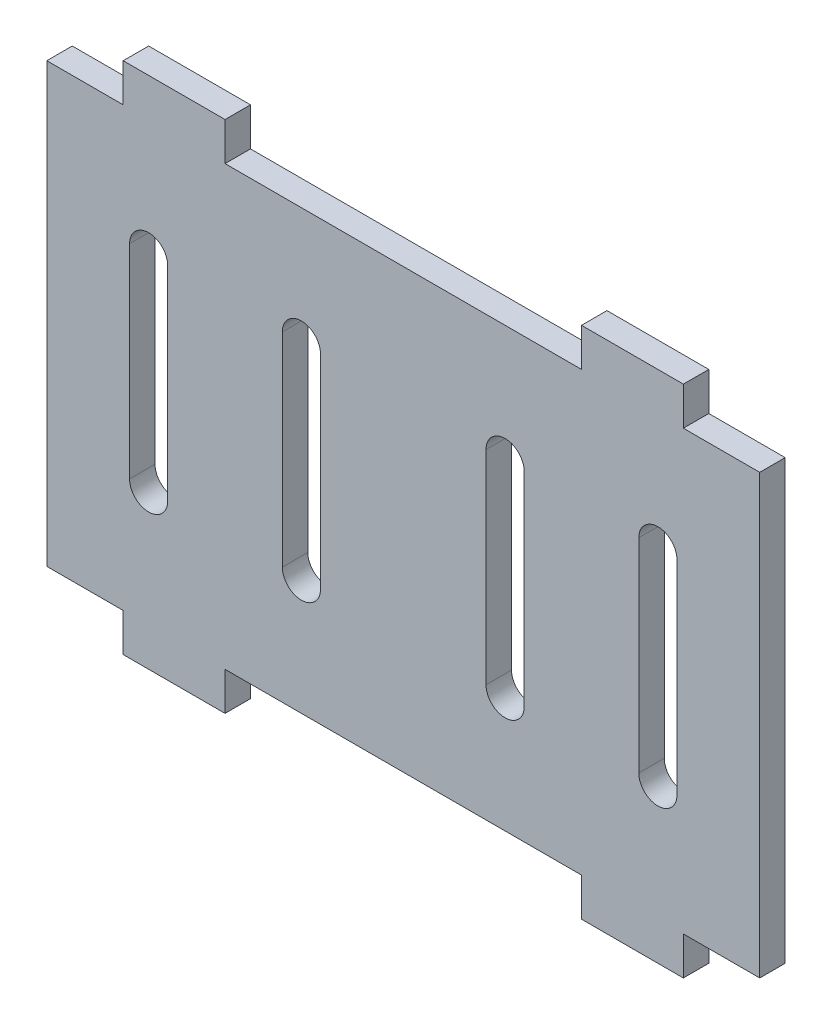
ISO-10303-21;
HEADER;
FILE_DESCRIPTION(('STEP AP214'),'2;1');
FILE_NAME('part.step','',(''),(''),'','','');
FILE_SCHEMA(('AUTOMOTIVE_DESIGN { 1 0 10303 214 1 1 1 1 }'));
ENDSEC;
DATA;
#1=APPLICATION_CONTEXT('core data for automotive mechanical design processes');
#2=APPLICATION_PROTOCOL_DEFINITION('international standard','automotive_design',2000,#1);
#3=PRODUCT_CONTEXT('',#1,'mechanical');
#4=PRODUCT('Part','Part','',(#3));
#5=PRODUCT_RELATED_PRODUCT_CATEGORY('part','',(#4));
#6=PRODUCT_DEFINITION_FORMATION('','',#4);
#7=PRODUCT_DEFINITION_CONTEXT('part definition',#1,'design');
#8=PRODUCT_DEFINITION('design','',#6,#7);
#9=PRODUCT_DEFINITION_SHAPE('','',#8);
#10=(LENGTH_UNIT() NAMED_UNIT(*) SI_UNIT(.MILLI.,.METRE.));
#11=(NAMED_UNIT(*) PLANE_ANGLE_UNIT() SI_UNIT($,.RADIAN.));
#12=(NAMED_UNIT(*) SI_UNIT($,.STERADIAN.) SOLID_ANGLE_UNIT());
#13=UNCERTAINTY_MEASURE_WITH_UNIT(LENGTH_MEASURE(1.E-05),#10,'distance_accuracy_value','');
#14=(GEOMETRIC_REPRESENTATION_CONTEXT(3) GLOBAL_UNCERTAINTY_ASSIGNED_CONTEXT((#13)) GLOBAL_UNIT_ASSIGNED_CONTEXT((#10,
#11,#12)) REPRESENTATION_CONTEXT('',''));
#15=CARTESIAN_POINT('',(0.,0.,0.));
#16=DIRECTION('',(0.,0.,1.));
#17=DIRECTION('',(1.,0.,0.));
#18=AXIS2_PLACEMENT_3D('',#15,#16,#17);
#19=CARTESIAN_POINT('',(0.,0.,2.));
#20=DIRECTION('',(0.,0.,1.));
#21=DIRECTION('',(1.,0.,0.));
#22=AXIS2_PLACEMENT_3D('',#19,#20,#21);
#23=PLANE('',#22);
#24=DIRECTION('',(1.,0.,0.));
#25=VECTOR('',#24,1.);
#26=CARTESIAN_POINT('',(0.,20.2,2.));
#27=LINE('',#26,#25);
#28=CARTESIAN_POINT('',(-22.,20.2,2.));
#29=VERTEX_POINT('',#28);
#30=CARTESIAN_POINT('',(-14.,20.2,2.));
#31=VERTEX_POINT('',#30);
#32=EDGE_CURVE('E268',#29,#31,#27,.T.);
#33=ORIENTED_EDGE('',*,*,#32,.F.);
#34=DIRECTION('',(0.,-1.,0.));
#35=VECTOR('',#34,1.);
#36=CARTESIAN_POINT('',(-22.,23.2,2.));
#37=LINE('',#36,#35);
#38=CARTESIAN_POINT('',(-22.,17.2,2.));
#39=VERTEX_POINT('',#38);
#40=EDGE_CURVE('E294',#29,#39,#37,.T.);
#41=ORIENTED_EDGE('',*,*,#40,.T.);
#42=DIRECTION('',(-1.,0.,0.));
#43=VECTOR('',#42,1.);
#44=CARTESIAN_POINT('',(-28.0000000000001,17.2,2.));
#45=LINE('',#44,#43);
#46=CARTESIAN_POINT('',(-28.0000000000001,17.2,2.));
#47=VERTEX_POINT('',#46);
#48=EDGE_CURVE('E320',#39,#47,#45,.T.);
#49=ORIENTED_EDGE('',*,*,#48,.T.);
#50=DIRECTION('',(0.,-1.,0.));
#51=VECTOR('',#50,1.);
#52=CARTESIAN_POINT('',(-28.0000000000001,17.2,2.));
#53=LINE('',#52,#51);
#54=CARTESIAN_POINT('',(-28.0000000000001,-17.2,2.));
#55=VERTEX_POINT('',#54);
#56=EDGE_CURVE('E309',#47,#55,#53,.T.);
#57=ORIENTED_EDGE('',*,*,#56,.T.);
#58=DIRECTION('',(1.,0.,0.));
#59=VECTOR('',#58,1.);
#60=CARTESIAN_POINT('',(-28.0000000000001,-17.2,2.));
#61=LINE('',#60,#59);
#62=CARTESIAN_POINT('',(-22.,-17.2,2.));
#63=VERTEX_POINT('',#62);
#64=EDGE_CURVE('E314',#55,#63,#61,.T.);
#65=ORIENTED_EDGE('',*,*,#64,.T.);
#66=DIRECTION('',(0.,1.,0.));
#67=VECTOR('',#66,1.);
#68=CARTESIAN_POINT('',(-22.,-23.2,2.));
#69=LINE('',#68,#67);
#70=CARTESIAN_POINT('',(-22.,-20.2,2.));
#71=VERTEX_POINT('',#70);
#72=EDGE_CURVE('E304',#71,#63,#69,.T.);
#73=ORIENTED_EDGE('',*,*,#72,.F.);
#74=DIRECTION('',(-1.,0.,0.));
#75=VECTOR('',#74,1.);
#76=CARTESIAN_POINT('',(0.,-20.2,2.));
#77=LINE('',#76,#75);
#78=CARTESIAN_POINT('',(-14.,-20.2,2.));
#79=VERTEX_POINT('',#78);
#80=EDGE_CURVE('E50',#79,#71,#77,.T.);
#81=ORIENTED_EDGE('',*,*,#80,.F.);
#82=DIRECTION('',(0.,1.,0.));
#83=VECTOR('',#82,1.);
#84=CARTESIAN_POINT('',(-14.,-23.2,2.));
#85=LINE('',#84,#83);
#86=CARTESIAN_POINT('',(-14.,-17.2,2.));
#87=VERTEX_POINT('',#86);
#88=EDGE_CURVE('E306',#79,#87,#85,.T.);
#89=ORIENTED_EDGE('',*,*,#88,.T.);
#90=CARTESIAN_POINT('',(14.,-17.2,2.));
#91=VERTEX_POINT('',#90);
#92=EDGE_CURVE('E318',#87,#91,#61,.T.);
#93=ORIENTED_EDGE('',*,*,#92,.T.);
#94=DIRECTION('',(0.,1.,0.));
#95=VECTOR('',#94,1.);
#96=CARTESIAN_POINT('',(14.,-23.2,2.));
#97=LINE('',#96,#95);
#98=CARTESIAN_POINT('',(14.,-20.2,2.));
#99=VERTEX_POINT('',#98);
#100=EDGE_CURVE('E426',#99,#91,#97,.T.);
#101=ORIENTED_EDGE('',*,*,#100,.F.);
#102=CARTESIAN_POINT('',(22.,-20.2,2.));
#103=VERTEX_POINT('',#102);
#104=EDGE_CURVE('E272',#103,#99,#77,.T.);
#105=ORIENTED_EDGE('',*,*,#104,.F.);
#106=DIRECTION('',(0.,1.,0.));
#107=VECTOR('',#106,1.);
#108=CARTESIAN_POINT('',(22.,-23.2,2.));
#109=LINE('',#108,#107);
#110=CARTESIAN_POINT('',(22.,-17.2,2.));
#111=VERTEX_POINT('',#110);
#112=EDGE_CURVE('E428',#103,#111,#109,.T.);
#113=ORIENTED_EDGE('',*,*,#112,.T.);
#114=CARTESIAN_POINT('',(27.9999999999999,-17.2,2.));
#115=VERTEX_POINT('',#114);
#116=EDGE_CURVE('E312',#111,#115,#61,.T.);
#117=ORIENTED_EDGE('',*,*,#116,.T.);
#118=DIRECTION('',(0.,1.,0.));
#119=VECTOR('',#118,1.);
#120=CARTESIAN_POINT('',(27.9999999999999,17.2,2.));
#121=LINE('',#120,#119);
#122=CARTESIAN_POINT('',(27.9999999999999,17.2,2.));
#123=VERTEX_POINT('',#122);
#124=EDGE_CURVE('E317',#115,#123,#121,.T.);
#125=ORIENTED_EDGE('',*,*,#124,.T.);
#126=CARTESIAN_POINT('',(22.,17.2,2.));
#127=VERTEX_POINT('',#126);
#128=EDGE_CURVE('E321',#123,#127,#45,.T.);
#129=ORIENTED_EDGE('',*,*,#128,.T.);
#130=DIRECTION('',(0.,-1.,0.));
#131=VECTOR('',#130,1.);
#132=CARTESIAN_POINT('',(22.,23.2,2.));
#133=LINE('',#132,#131);
#134=CARTESIAN_POINT('',(22.,20.2,2.));
#135=VERTEX_POINT('',#134);
#136=EDGE_CURVE('E403',#135,#127,#133,.T.);
#137=ORIENTED_EDGE('',*,*,#136,.F.);
#138=CARTESIAN_POINT('',(14.,20.2,2.));
#139=VERTEX_POINT('',#138);
#140=EDGE_CURVE('E282',#139,#135,#27,.T.);
#141=ORIENTED_EDGE('',*,*,#140,.F.);
#142=DIRECTION('',(0.,-1.,0.));
#143=VECTOR('',#142,1.);
#144=CARTESIAN_POINT('',(14.,23.2,2.));
#145=LINE('',#144,#143);
#146=CARTESIAN_POINT('',(14.,17.2,2.));
#147=VERTEX_POINT('',#146);
#148=EDGE_CURVE('E413',#139,#147,#145,.T.);
#149=ORIENTED_EDGE('',*,*,#148,.T.);
#150=CARTESIAN_POINT('',(-14.,17.2,2.));
#151=VERTEX_POINT('',#150);
#152=EDGE_CURVE('E325',#147,#151,#45,.T.);
#153=ORIENTED_EDGE('',*,*,#152,.T.);
#154=DIRECTION('',(0.,-1.,0.));
#155=VECTOR('',#154,1.);
#156=CARTESIAN_POINT('',(-14.,23.2,2.));
#157=LINE('',#156,#155);
#158=EDGE_CURVE('E438',#31,#151,#157,.T.);
#159=ORIENTED_EDGE('',*,*,#158,.F.);
#160=EDGE_LOOP('',(#33,#41,#49,#57,#65,#73,#81,#89,#93,#101,#105,#113,#117,#125,#129,#137,#141,
#149,#153,#159));
#161=FACE_BOUND('',#160,.T.);
#162=CARTESIAN_POINT('',(-20.,-7.99999999999998,2.));
#163=DIRECTION('',(0.,0.,1.));
#164=DIRECTION('',(1.,0.,0.));
#165=AXIS2_PLACEMENT_3D('',#162,#163,#164);
#166=CIRCLE('',#165,1.5);
#167=CARTESIAN_POINT('',(-21.5,-8.00000000000001,2.));
#168=VERTEX_POINT('',#167);
#169=CARTESIAN_POINT('',(-18.5,-8.00000000000001,2.));
#170=VERTEX_POINT('',#169);
#171=EDGE_CURVE('E478',#168,#170,#166,.T.);
#172=ORIENTED_EDGE('',*,*,#171,.F.);
#173=DIRECTION('',(0.,-1.,0.));
#174=VECTOR('',#173,1.);
#175=CARTESIAN_POINT('',(-21.5,-8.00000000000001,2.));
#176=LINE('',#175,#174);
#177=CARTESIAN_POINT('',(-21.5,8.,2.));
#178=VERTEX_POINT('',#177);
#179=EDGE_CURVE('E487',#178,#168,#176,.T.);
#180=ORIENTED_EDGE('',*,*,#179,.F.);
#181=CARTESIAN_POINT('',(-20.,7.99999999999999,2.));
#182=DIRECTION('',(0.,0.,1.));
#183=DIRECTION('',(1.,0.,0.));
#184=AXIS2_PLACEMENT_3D('',#181,#182,#183);
#185=CIRCLE('',#184,1.5);
#186=CARTESIAN_POINT('',(-18.5,8.,2.));
#187=VERTEX_POINT('',#186);
#188=EDGE_CURVE('E484',#187,#178,#185,.T.);
#189=ORIENTED_EDGE('',*,*,#188,.F.);
#190=DIRECTION('',(0.,1.,0.));
#191=VECTOR('',#190,1.);
#192=CARTESIAN_POINT('',(-18.5,-8.00000000000001,2.));
#193=LINE('',#192,#191);
#194=EDGE_CURVE('E480',#170,#187,#193,.T.);
#195=ORIENTED_EDGE('',*,*,#194,.F.);
#196=EDGE_LOOP('',(#172,#180,#189,#195));
#197=FACE_BOUND('',#196,.T.);
#198=CARTESIAN_POINT('',(-8.,-8.,2.));
#199=DIRECTION('',(0.,0.,1.));
#200=DIRECTION('',(1.,0.,0.));
#201=AXIS2_PLACEMENT_3D('',#198,#199,#200);
#202=CIRCLE('',#201,1.5);
#203=CARTESIAN_POINT('',(-9.5,-8.00000000000001,2.));
#204=VERTEX_POINT('',#203);
#205=CARTESIAN_POINT('',(-6.5,-8.00000000000001,2.));
#206=VERTEX_POINT('',#205);
#207=EDGE_CURVE('E499',#204,#206,#202,.T.);
#208=ORIENTED_EDGE('',*,*,#207,.F.);
#209=DIRECTION('',(0.,-1.,0.));
#210=VECTOR('',#209,1.);
#211=CARTESIAN_POINT('',(-9.5,-8.00000000000001,2.));
#212=LINE('',#211,#210);
#213=CARTESIAN_POINT('',(-9.5,8.,2.));
#214=VERTEX_POINT('',#213);
#215=EDGE_CURVE('E508',#214,#204,#212,.T.);
#216=ORIENTED_EDGE('',*,*,#215,.F.);
#217=CARTESIAN_POINT('',(-8.,8.,2.));
#218=DIRECTION('',(0.,0.,1.));
#219=DIRECTION('',(1.,0.,0.));
#220=AXIS2_PLACEMENT_3D('',#217,#218,#219);
#221=CIRCLE('',#220,1.5);
#222=CARTESIAN_POINT('',(-6.5,8.00000000000001,2.));
#223=VERTEX_POINT('',#222);
#224=EDGE_CURVE('E505',#223,#214,#221,.T.);
#225=ORIENTED_EDGE('',*,*,#224,.F.);
#226=DIRECTION('',(0.,1.,0.));
#227=VECTOR('',#226,1.);
#228=CARTESIAN_POINT('',(-6.5,-8.00000000000001,2.));
#229=LINE('',#228,#227);
#230=EDGE_CURVE('E501',#206,#223,#229,.T.);
#231=ORIENTED_EDGE('',*,*,#230,.F.);
#232=EDGE_LOOP('',(#208,#216,#225,#231));
#233=FACE_BOUND('',#232,.T.);
#234=CARTESIAN_POINT('',(8.,-8.,2.));
#235=DIRECTION('',(0.,0.,1.));
#236=DIRECTION('',(1.,0.,0.));
#237=AXIS2_PLACEMENT_3D('',#234,#235,#236);
#238=CIRCLE('',#237,1.5);
#239=CARTESIAN_POINT('',(6.5,-8.00000000000001,2.));
#240=VERTEX_POINT('',#239);
#241=CARTESIAN_POINT('',(9.5,-8.,2.));
#242=VERTEX_POINT('',#241);
#243=EDGE_CURVE('E519',#240,#242,#238,.T.);
#244=ORIENTED_EDGE('',*,*,#243,.F.);
#245=DIRECTION('',(0.,-1.,0.));
#246=VECTOR('',#245,1.);
#247=CARTESIAN_POINT('',(6.5,-8.00000000000001,2.));
#248=LINE('',#247,#246);
#249=CARTESIAN_POINT('',(6.5,8.00000000000001,2.));
#250=VERTEX_POINT('',#249);
#251=EDGE_CURVE('E528',#250,#240,#248,.T.);
#252=ORIENTED_EDGE('',*,*,#251,.F.);
#253=CARTESIAN_POINT('',(8.,8.,2.));
#254=DIRECTION('',(0.,0.,1.));
#255=DIRECTION('',(1.,0.,0.));
#256=AXIS2_PLACEMENT_3D('',#253,#254,#255);
#257=CIRCLE('',#256,1.5);
#258=CARTESIAN_POINT('',(9.5,8.00000000000001,2.));
#259=VERTEX_POINT('',#258);
#260=EDGE_CURVE('E525',#259,#250,#257,.T.);
#261=ORIENTED_EDGE('',*,*,#260,.F.);
#262=DIRECTION('',(0.,1.,0.));
#263=VECTOR('',#262,1.);
#264=CARTESIAN_POINT('',(9.5,-8.,2.));
#265=LINE('',#264,#263);
#266=EDGE_CURVE('E521',#242,#259,#265,.T.);
#267=ORIENTED_EDGE('',*,*,#266,.F.);
#268=EDGE_LOOP('',(#244,#252,#261,#267));
#269=FACE_BOUND('',#268,.T.);
#270=CARTESIAN_POINT('',(20.,-8.,2.));
#271=DIRECTION('',(0.,0.,1.));
#272=DIRECTION('',(-1.,0.,0.));
#273=AXIS2_PLACEMENT_3D('',#270,#271,#272);
#274=CIRCLE('',#273,1.50000000000001);
#275=CARTESIAN_POINT('',(18.5,-8.,2.));
#276=VERTEX_POINT('',#275);
#277=CARTESIAN_POINT('',(21.5,-8.,2.));
#278=VERTEX_POINT('',#277);
#279=EDGE_CURVE('E477',#276,#278,#274,.T.);
#280=ORIENTED_EDGE('',*,*,#279,.F.);
#281=DIRECTION('',(0.,-1.,0.));
#282=VECTOR('',#281,1.);
#283=CARTESIAN_POINT('',(18.5,-8.,2.));
#284=LINE('',#283,#282);
#285=CARTESIAN_POINT('',(18.5,8.00000000000001,2.));
#286=VERTEX_POINT('',#285);
#287=EDGE_CURVE('E546',#286,#276,#284,.T.);
#288=ORIENTED_EDGE('',*,*,#287,.F.);
#289=CARTESIAN_POINT('',(20.,8.,2.));
#290=DIRECTION('',(0.,0.,1.));
#291=DIRECTION('',(-1.,0.,0.));
#292=AXIS2_PLACEMENT_3D('',#289,#290,#291);
#293=CIRCLE('',#292,1.50000000000001);
#294=CARTESIAN_POINT('',(21.5,8.00000000000001,2.));
#295=VERTEX_POINT('',#294);
#296=EDGE_CURVE('E543',#295,#286,#293,.T.);
#297=ORIENTED_EDGE('',*,*,#296,.F.);
#298=DIRECTION('',(0.,1.,0.));
#299=VECTOR('',#298,1.);
#300=CARTESIAN_POINT('',(21.5,-8.,2.));
#301=LINE('',#300,#299);
#302=EDGE_CURVE('E540',#278,#295,#301,.T.);
#303=ORIENTED_EDGE('',*,*,#302,.F.);
#304=EDGE_LOOP('',(#280,#288,#297,#303));
#305=FACE_BOUND('',#304,.T.);
#306=ADVANCED_FACE('F35',(#161,#197,#233,#269,#305),#23,.T.);
#307=CARTESIAN_POINT('',(-28.0000000000001,17.2,2.));
#308=DIRECTION('',(0.,-1.,0.));
#309=DIRECTION('',(0.,0.,-1.));
#310=AXIS2_PLACEMENT_3D('',#307,#308,#309);
#311=PLANE('',#310);
#312=DIRECTION('',(0.,0.,1.));
#313=VECTOR('',#312,1.);
#314=CARTESIAN_POINT('',(14.,17.2,0.));
#315=LINE('',#314,#313);
#316=CARTESIAN_POINT('',(14.,17.2,0.));
#317=VERTEX_POINT('',#316);
#318=EDGE_CURVE('E454',#317,#147,#315,.T.);
#319=ORIENTED_EDGE('',*,*,#318,.F.);
#320=DIRECTION('',(-1.,0.,0.));
#321=VECTOR('',#320,1.);
#322=CARTESIAN_POINT('',(-28.0000000000001,17.2,0.));
#323=LINE('',#322,#321);
#324=CARTESIAN_POINT('',(-14.,17.2,0.));
#325=VERTEX_POINT('',#324);
#326=EDGE_CURVE('E338',#317,#325,#323,.T.);
#327=ORIENTED_EDGE('',*,*,#326,.T.);
#328=DIRECTION('',(0.,0.,1.));
#329=VECTOR('',#328,1.);
#330=CARTESIAN_POINT('',(-14.,17.2,0.));
#331=LINE('',#330,#329);
#332=EDGE_CURVE('E288',#325,#151,#331,.T.);
#333=ORIENTED_EDGE('',*,*,#332,.T.);
#334=ORIENTED_EDGE('',*,*,#152,.F.);
#335=EDGE_LOOP('',(#319,#327,#333,#334));
#336=FACE_BOUND('',#335,.T.);
#337=ADVANCED_FACE('F453',(#336),#311,.F.);
#338=DIRECTION('',(0.,0.,-1.));
#339=VECTOR('',#338,1.);
#340=CARTESIAN_POINT('',(22.,17.2,0.));
#341=LINE('',#340,#339);
#342=CARTESIAN_POINT('',(22.,17.2,0.));
#343=VERTEX_POINT('',#342);
#344=EDGE_CURVE('E558',#127,#343,#341,.T.);
#345=ORIENTED_EDGE('',*,*,#344,.F.);
#346=ORIENTED_EDGE('',*,*,#128,.F.);
#347=DIRECTION('',(0.,0.,-1.));
#348=VECTOR('',#347,1.);
#349=CARTESIAN_POINT('',(27.9999999999999,17.2,2.));
#350=LINE('',#349,#348);
#351=CARTESIAN_POINT('',(27.9999999999999,17.2,0.));
#352=VERTEX_POINT('',#351);
#353=EDGE_CURVE('E341',#123,#352,#350,.T.);
#354=ORIENTED_EDGE('',*,*,#353,.T.);
#355=EDGE_CURVE('E313',#352,#343,#323,.T.);
#356=ORIENTED_EDGE('',*,*,#355,.T.);
#357=EDGE_LOOP('',(#345,#346,#354,#356));
#358=FACE_BOUND('',#357,.T.);
#359=ADVANCED_FACE('F599',(#358),#311,.F.);
#360=CARTESIAN_POINT('',(-28.0000000000001,-17.2,2.));
#361=DIRECTION('',(0.,1.,0.));
#362=DIRECTION('',(0.,0.,1.));
#363=AXIS2_PLACEMENT_3D('',#360,#361,#362);
#364=PLANE('',#363);
#365=DIRECTION('',(1.,0.,0.));
#366=VECTOR('',#365,1.);
#367=CARTESIAN_POINT('',(-28.0000000000001,-17.2,0.));
#368=LINE('',#367,#366);
#369=CARTESIAN_POINT('',(-14.,-17.2,0.));
#370=VERTEX_POINT('',#369);
#371=CARTESIAN_POINT('',(14.,-17.2,0.));
#372=VERTEX_POINT('',#371);
#373=EDGE_CURVE('E333',#370,#372,#368,.T.);
#374=ORIENTED_EDGE('',*,*,#373,.T.);
#375=DIRECTION('',(0.,0.,1.));
#376=VECTOR('',#375,1.);
#377=CARTESIAN_POINT('',(14.,-17.2,0.));
#378=LINE('',#377,#376);
#379=EDGE_CURVE('E415',#372,#91,#378,.T.);
#380=ORIENTED_EDGE('',*,*,#379,.T.);
#381=ORIENTED_EDGE('',*,*,#92,.F.);
#382=DIRECTION('',(0.,0.,1.));
#383=VECTOR('',#382,1.);
#384=CARTESIAN_POINT('',(-14.,-17.2,0.));
#385=LINE('',#384,#383);
#386=EDGE_CURVE('E289',#370,#87,#385,.T.);
#387=ORIENTED_EDGE('',*,*,#386,.F.);
#388=EDGE_LOOP('',(#374,#380,#381,#387));
#389=FACE_BOUND('',#388,.T.);
#390=ADVANCED_FACE('F627',(#389),#364,.F.);
#391=ORIENTED_EDGE('',*,*,#116,.F.);
#392=DIRECTION('',(0.,0.,-1.));
#393=VECTOR('',#392,1.);
#394=CARTESIAN_POINT('',(22.,-17.2,0.));
#395=LINE('',#394,#393);
#396=CARTESIAN_POINT('',(22.,-17.2,0.));
#397=VERTEX_POINT('',#396);
#398=EDGE_CURVE('E423',#111,#397,#395,.T.);
#399=ORIENTED_EDGE('',*,*,#398,.T.);
#400=CARTESIAN_POINT('',(27.9999999999999,-17.2,0.));
#401=VERTEX_POINT('',#400);
#402=EDGE_CURVE('E328',#397,#401,#368,.T.);
#403=ORIENTED_EDGE('',*,*,#402,.T.);
#404=DIRECTION('',(0.,0.,-1.));
#405=VECTOR('',#404,1.);
#406=CARTESIAN_POINT('',(27.9999999999999,-17.2,2.));
#407=LINE('',#406,#405);
#408=EDGE_CURVE('E344',#115,#401,#407,.T.);
#409=ORIENTED_EDGE('',*,*,#408,.F.);
#410=EDGE_LOOP('',(#391,#399,#403,#409));
#411=FACE_BOUND('',#410,.T.);
#412=ADVANCED_FACE('F593',(#411),#364,.F.);
#413=DIRECTION('',(0.,0.,-1.));
#414=VECTOR('',#413,1.);
#415=CARTESIAN_POINT('',(-22.,-17.2,0.));
#416=LINE('',#415,#414);
#417=CARTESIAN_POINT('',(-22.,-17.2,0.));
#418=VERTEX_POINT('',#417);
#419=EDGE_CURVE('E292',#63,#418,#416,.T.);
#420=ORIENTED_EDGE('',*,*,#419,.F.);
#421=ORIENTED_EDGE('',*,*,#64,.F.);
#422=DIRECTION('',(0.,0.,-1.));
#423=VECTOR('',#422,1.);
#424=CARTESIAN_POINT('',(-28.0000000000001,-17.2,2.));
#425=LINE('',#424,#423);
#426=CARTESIAN_POINT('',(-28.0000000000001,-17.2,0.));
#427=VERTEX_POINT('',#426);
#428=EDGE_CURVE('E347',#55,#427,#425,.T.);
#429=ORIENTED_EDGE('',*,*,#428,.T.);
#430=EDGE_CURVE('E329',#427,#418,#368,.T.);
#431=ORIENTED_EDGE('',*,*,#430,.T.);
#432=EDGE_LOOP('',(#420,#421,#429,#431));
#433=FACE_BOUND('',#432,.T.);
#434=ADVANCED_FACE('F463',(#433),#364,.F.);
#435=CARTESIAN_POINT('',(-28.0000000000001,17.2,2.));
#436=DIRECTION('',(1.,0.,0.));
#437=DIRECTION('',(0.,0.,-1.));
#438=AXIS2_PLACEMENT_3D('',#435,#436,#437);
#439=PLANE('',#438);
#440=DIRECTION('',(0.,-1.,0.));
#441=VECTOR('',#440,1.);
#442=CARTESIAN_POINT('',(-28.0000000000001,17.2,0.));
#443=LINE('',#442,#441);
#444=CARTESIAN_POINT('',(-28.0000000000001,17.2,0.));
#445=VERTEX_POINT('',#444);
#446=EDGE_CURVE('E308',#445,#427,#443,.T.);
#447=ORIENTED_EDGE('',*,*,#446,.T.);
#448=ORIENTED_EDGE('',*,*,#428,.F.);
#449=ORIENTED_EDGE('',*,*,#56,.F.);
#450=DIRECTION('',(0.,0.,-1.));
#451=VECTOR('',#450,1.);
#452=CARTESIAN_POINT('',(-28.0000000000001,17.2,2.));
#453=LINE('',#452,#451);
#454=EDGE_CURVE('E324',#47,#445,#453,.T.);
#455=ORIENTED_EDGE('',*,*,#454,.T.);
#456=EDGE_LOOP('',(#447,#448,#449,#455));
#457=FACE_BOUND('',#456,.T.);
#458=ADVANCED_FACE('F37',(#457),#439,.F.);
#459=CARTESIAN_POINT('',(27.9999999999999,17.2,2.));
#460=DIRECTION('',(-1.,0.,0.));
#461=DIRECTION('',(0.,0.,1.));
#462=AXIS2_PLACEMENT_3D('',#459,#460,#461);
#463=PLANE('',#462);
#464=DIRECTION('',(0.,1.,0.));
#465=VECTOR('',#464,1.);
#466=CARTESIAN_POINT('',(27.9999999999999,17.2,0.));
#467=LINE('',#466,#465);
#468=EDGE_CURVE('E332',#401,#352,#467,.T.);
#469=ORIENTED_EDGE('',*,*,#468,.T.);
#470=ORIENTED_EDGE('',*,*,#353,.F.);
#471=ORIENTED_EDGE('',*,*,#124,.F.);
#472=ORIENTED_EDGE('',*,*,#408,.T.);
#473=EDGE_LOOP('',(#469,#470,#471,#472));
#474=FACE_BOUND('',#473,.T.);
#475=ADVANCED_FACE('F597',(#474),#463,.F.);
#476=ORIENTED_EDGE('',*,*,#48,.F.);
#477=DIRECTION('',(0.,0.,-1.));
#478=VECTOR('',#477,1.);
#479=CARTESIAN_POINT('',(-22.,17.2,0.));
#480=LINE('',#479,#478);
#481=CARTESIAN_POINT('',(-22.,17.2,0.));
#482=VERTEX_POINT('',#481);
#483=EDGE_CURVE('E435',#39,#482,#480,.T.);
#484=ORIENTED_EDGE('',*,*,#483,.T.);
#485=EDGE_CURVE('E335',#482,#445,#323,.T.);
#486=ORIENTED_EDGE('',*,*,#485,.T.);
#487=ORIENTED_EDGE('',*,*,#454,.F.);
#488=EDGE_LOOP('',(#476,#484,#486,#487));
#489=FACE_BOUND('',#488,.T.);
#490=ADVANCED_FACE('F446',(#489),#311,.F.);
#491=CARTESIAN_POINT('',(0.,0.,0.));
#492=DIRECTION('',(0.,0.,1.));
#493=DIRECTION('',(1.,0.,0.));
#494=AXIS2_PLACEMENT_3D('',#491,#492,#493);
#495=PLANE('',#494);
#496=DIRECTION('',(0.,-1.,0.));
#497=VECTOR('',#496,1.);
#498=CARTESIAN_POINT('',(-21.5,0.,0.));
#499=LINE('',#498,#497);
#500=CARTESIAN_POINT('',(-21.5,8.,0.));
#501=VERTEX_POINT('',#500);
#502=CARTESIAN_POINT('',(-21.5,-8.00000000000001,0.));
#503=VERTEX_POINT('',#502);
#504=EDGE_CURVE('E392',#501,#503,#499,.T.);
#505=ORIENTED_EDGE('',*,*,#504,.T.);
#506=CARTESIAN_POINT('',(-20.,-7.99999999999998,0.));
#507=DIRECTION('',(0.,0.,1.));
#508=DIRECTION('',(1.,0.,0.));
#509=AXIS2_PLACEMENT_3D('',#506,#507,#508);
#510=CIRCLE('',#509,1.5);
#511=CARTESIAN_POINT('',(-18.5,-8.00000000000001,0.));
#512=VERTEX_POINT('',#511);
#513=EDGE_CURVE('E395',#503,#512,#510,.T.);
#514=ORIENTED_EDGE('',*,*,#513,.T.);
#515=DIRECTION('',(0.,1.,0.));
#516=VECTOR('',#515,1.);
#517=CARTESIAN_POINT('',(-18.5,0.,0.));
#518=LINE('',#517,#516);
#519=CARTESIAN_POINT('',(-18.5,8.,0.));
#520=VERTEX_POINT('',#519);
#521=EDGE_CURVE('E386',#512,#520,#518,.T.);
#522=ORIENTED_EDGE('',*,*,#521,.T.);
#523=CARTESIAN_POINT('',(-20.,7.99999999999999,0.));
#524=DIRECTION('',(0.,0.,1.));
#525=DIRECTION('',(1.,0.,0.));
#526=AXIS2_PLACEMENT_3D('',#523,#524,#525);
#527=CIRCLE('',#526,1.5);
#528=EDGE_CURVE('E389',#520,#501,#527,.T.);
#529=ORIENTED_EDGE('',*,*,#528,.T.);
#530=EDGE_LOOP('',(#505,#514,#522,#529));
#531=FACE_BOUND('',#530,.T.);
#532=DIRECTION('',(0.,-1.,0.));
#533=VECTOR('',#532,1.);
#534=CARTESIAN_POINT('',(-9.5,0.,0.));
#535=LINE('',#534,#533);
#536=CARTESIAN_POINT('',(-9.5,8.,0.));
#537=VERTEX_POINT('',#536);
#538=CARTESIAN_POINT('',(-9.5,-8.00000000000001,0.));
#539=VERTEX_POINT('',#538);
#540=EDGE_CURVE('E380',#537,#539,#535,.T.);
#541=ORIENTED_EDGE('',*,*,#540,.T.);
#542=CARTESIAN_POINT('',(-8.,-8.,0.));
#543=DIRECTION('',(0.,0.,1.));
#544=DIRECTION('',(1.,0.,0.));
#545=AXIS2_PLACEMENT_3D('',#542,#543,#544);
#546=CIRCLE('',#545,1.5);
#547=CARTESIAN_POINT('',(-6.5,-8.00000000000001,0.));
#548=VERTEX_POINT('',#547);
#549=EDGE_CURVE('E383',#539,#548,#546,.T.);
#550=ORIENTED_EDGE('',*,*,#549,.T.);
#551=DIRECTION('',(0.,1.,0.));
#552=VECTOR('',#551,1.);
#553=CARTESIAN_POINT('',(-6.5,0.,0.));
#554=LINE('',#553,#552);
#555=CARTESIAN_POINT('',(-6.5,8.00000000000001,0.));
#556=VERTEX_POINT('',#555);
#557=EDGE_CURVE('E374',#548,#556,#554,.T.);
#558=ORIENTED_EDGE('',*,*,#557,.T.);
#559=CARTESIAN_POINT('',(-8.,8.,0.));
#560=DIRECTION('',(0.,0.,1.));
#561=DIRECTION('',(1.,0.,0.));
#562=AXIS2_PLACEMENT_3D('',#559,#560,#561);
#563=CIRCLE('',#562,1.5);
#564=EDGE_CURVE('E377',#556,#537,#563,.T.);
#565=ORIENTED_EDGE('',*,*,#564,.T.);
#566=EDGE_LOOP('',(#541,#550,#558,#565));
#567=FACE_BOUND('',#566,.T.);
#568=DIRECTION('',(0.,-1.,0.));
#569=VECTOR('',#568,1.);
#570=CARTESIAN_POINT('',(6.5,0.,0.));
#571=LINE('',#570,#569);
#572=CARTESIAN_POINT('',(6.5,8.00000000000001,0.));
#573=VERTEX_POINT('',#572);
#574=CARTESIAN_POINT('',(6.5,-8.00000000000001,0.));
#575=VERTEX_POINT('',#574);
#576=EDGE_CURVE('E368',#573,#575,#571,.T.);
#577=ORIENTED_EDGE('',*,*,#576,.T.);
#578=CARTESIAN_POINT('',(8.,-8.,0.));
#579=DIRECTION('',(0.,0.,1.));
#580=DIRECTION('',(1.,0.,0.));
#581=AXIS2_PLACEMENT_3D('',#578,#579,#580);
#582=CIRCLE('',#581,1.5);
#583=CARTESIAN_POINT('',(9.5,-8.,0.));
#584=VERTEX_POINT('',#583);
#585=EDGE_CURVE('E371',#575,#584,#582,.T.);
#586=ORIENTED_EDGE('',*,*,#585,.T.);
#587=DIRECTION('',(0.,1.,0.));
#588=VECTOR('',#587,1.);
#589=CARTESIAN_POINT('',(9.5,0.,0.));
#590=LINE('',#589,#588);
#591=CARTESIAN_POINT('',(9.5,8.00000000000001,0.));
#592=VERTEX_POINT('',#591);
#593=EDGE_CURVE('E362',#584,#592,#590,.T.);
#594=ORIENTED_EDGE('',*,*,#593,.T.);
#595=CARTESIAN_POINT('',(8.,8.,0.));
#596=DIRECTION('',(0.,0.,1.));
#597=DIRECTION('',(1.,0.,0.));
#598=AXIS2_PLACEMENT_3D('',#595,#596,#597);
#599=CIRCLE('',#598,1.5);
#600=EDGE_CURVE('E365',#592,#573,#599,.T.);
#601=ORIENTED_EDGE('',*,*,#600,.T.);
#602=EDGE_LOOP('',(#577,#586,#594,#601));
#603=FACE_BOUND('',#602,.T.);
#604=DIRECTION('',(0.,-1.,0.));
#605=VECTOR('',#604,1.);
#606=CARTESIAN_POINT('',(18.5,0.,0.));
#607=LINE('',#606,#605);
#608=CARTESIAN_POINT('',(18.5,8.00000000000001,0.));
#609=VERTEX_POINT('',#608);
#610=CARTESIAN_POINT('',(18.5,-8.,0.));
#611=VERTEX_POINT('',#610);
#612=EDGE_CURVE('E356',#609,#611,#607,.T.);
#613=ORIENTED_EDGE('',*,*,#612,.T.);
#614=CARTESIAN_POINT('',(20.,-8.,0.));
#615=DIRECTION('',(0.,0.,1.));
#616=DIRECTION('',(1.,0.,0.));
#617=AXIS2_PLACEMENT_3D('',#614,#615,#616);
#618=CIRCLE('',#617,1.50000000000001);
#619=CARTESIAN_POINT('',(21.5,-8.,0.));
#620=VERTEX_POINT('',#619);
#621=EDGE_CURVE('E359',#611,#620,#618,.T.);
#622=ORIENTED_EDGE('',*,*,#621,.T.);
#623=DIRECTION('',(0.,1.,0.));
#624=VECTOR('',#623,1.);
#625=CARTESIAN_POINT('',(21.5,0.,0.));
#626=LINE('',#625,#624);
#627=CARTESIAN_POINT('',(21.5,8.00000000000001,0.));
#628=VERTEX_POINT('',#627);
#629=EDGE_CURVE('E350',#620,#628,#626,.T.);
#630=ORIENTED_EDGE('',*,*,#629,.T.);
#631=CARTESIAN_POINT('',(20.,8.,0.));
#632=DIRECTION('',(0.,0.,1.));
#633=DIRECTION('',(1.,0.,0.));
#634=AXIS2_PLACEMENT_3D('',#631,#632,#633);
#635=CIRCLE('',#634,1.50000000000001);
#636=EDGE_CURVE('E353',#628,#609,#635,.T.);
#637=ORIENTED_EDGE('',*,*,#636,.T.);
#638=EDGE_LOOP('',(#613,#622,#630,#637));
#639=FACE_BOUND('',#638,.T.);
#640=DIRECTION('',(0.,-1.,0.));
#641=VECTOR('',#640,1.);
#642=CARTESIAN_POINT('',(-22.,23.2,0.));
#643=LINE('',#642,#641);
#644=CARTESIAN_POINT('',(-22.,20.2,0.));
#645=VERTEX_POINT('',#644);
#646=EDGE_CURVE('E281',#645,#482,#643,.T.);
#647=ORIENTED_EDGE('',*,*,#646,.F.);
#648=DIRECTION('',(1.,0.,0.));
#649=VECTOR('',#648,1.);
#650=CARTESIAN_POINT('',(-30.342378223589,20.2,0.));
#651=LINE('',#650,#649);
#652=CARTESIAN_POINT('',(-14.,20.2,0.));
#653=VERTEX_POINT('',#652);
#654=EDGE_CURVE('E58',#645,#653,#651,.T.);
#655=ORIENTED_EDGE('',*,*,#654,.T.);
#656=DIRECTION('',(0.,-1.,0.));
#657=VECTOR('',#656,1.);
#658=CARTESIAN_POINT('',(-14.,23.2,0.));
#659=LINE('',#658,#657);
#660=EDGE_CURVE('E278',#653,#325,#659,.T.);
#661=ORIENTED_EDGE('',*,*,#660,.T.);
#662=ORIENTED_EDGE('',*,*,#326,.F.);
#663=DIRECTION('',(0.,-1.,0.));
#664=VECTOR('',#663,1.);
#665=CARTESIAN_POINT('',(14.,23.2,0.));
#666=LINE('',#665,#664);
#667=CARTESIAN_POINT('',(14.,20.2,0.));
#668=VERTEX_POINT('',#667);
#669=EDGE_CURVE('E417',#668,#317,#666,.T.);
#670=ORIENTED_EDGE('',*,*,#669,.F.);
#671=CARTESIAN_POINT('',(22.,20.2,0.));
#672=VERTEX_POINT('',#671);
#673=EDGE_CURVE('E283',#668,#672,#651,.T.);
#674=ORIENTED_EDGE('',*,*,#673,.T.);
#675=DIRECTION('',(0.,-1.,0.));
#676=VECTOR('',#675,1.);
#677=CARTESIAN_POINT('',(22.,23.2,0.));
#678=LINE('',#677,#676);
#679=EDGE_CURVE('E405',#672,#343,#678,.T.);
#680=ORIENTED_EDGE('',*,*,#679,.T.);
#681=ORIENTED_EDGE('',*,*,#355,.F.);
#682=ORIENTED_EDGE('',*,*,#468,.F.);
#683=ORIENTED_EDGE('',*,*,#402,.F.);
#684=DIRECTION('',(0.,1.,0.));
#685=VECTOR('',#684,1.);
#686=CARTESIAN_POINT('',(22.,-23.2,0.));
#687=LINE('',#686,#685);
#688=CARTESIAN_POINT('',(22.,-20.2,0.));
#689=VERTEX_POINT('',#688);
#690=EDGE_CURVE('E430',#689,#397,#687,.T.);
#691=ORIENTED_EDGE('',*,*,#690,.F.);
#692=DIRECTION('',(-1.,0.,0.));
#693=VECTOR('',#692,1.);
#694=CARTESIAN_POINT('',(37.2441950615051,-20.2,0.));
#695=LINE('',#694,#693);
#696=CARTESIAN_POINT('',(14.,-20.2,0.));
#697=VERTEX_POINT('',#696);
#698=EDGE_CURVE('E564',#689,#697,#695,.T.);
#699=ORIENTED_EDGE('',*,*,#698,.T.);
#700=DIRECTION('',(0.,1.,0.));
#701=VECTOR('',#700,1.);
#702=CARTESIAN_POINT('',(14.,-23.2,0.));
#703=LINE('',#702,#701);
#704=EDGE_CURVE('E432',#697,#372,#703,.T.);
#705=ORIENTED_EDGE('',*,*,#704,.T.);
#706=ORIENTED_EDGE('',*,*,#373,.F.);
#707=DIRECTION('',(0.,1.,0.));
#708=VECTOR('',#707,1.);
#709=CARTESIAN_POINT('',(-14.,-23.2,0.));
#710=LINE('',#709,#708);
#711=CARTESIAN_POINT('',(-14.,-20.2,0.));
#712=VERTEX_POINT('',#711);
#713=EDGE_CURVE('E300',#712,#370,#710,.T.);
#714=ORIENTED_EDGE('',*,*,#713,.F.);
#715=CARTESIAN_POINT('',(-22.,-20.2,0.));
#716=VERTEX_POINT('',#715);
#717=EDGE_CURVE('E566',#712,#716,#695,.T.);
#718=ORIENTED_EDGE('',*,*,#717,.T.);
#719=DIRECTION('',(0.,1.,0.));
#720=VECTOR('',#719,1.);
#721=CARTESIAN_POINT('',(-22.,-23.2,0.));
#722=LINE('',#721,#720);
#723=EDGE_CURVE('E302',#716,#418,#722,.T.);
#724=ORIENTED_EDGE('',*,*,#723,.T.);
#725=ORIENTED_EDGE('',*,*,#430,.F.);
#726=ORIENTED_EDGE('',*,*,#446,.F.);
#727=ORIENTED_EDGE('',*,*,#485,.F.);
#728=EDGE_LOOP('',(#647,#655,#661,#662,#670,#674,#680,#681,#682,#683,#691,#699,#705,#706,#714,
#718,#724,#725,#726,#727));
#729=FACE_BOUND('',#728,.T.);
#730=ADVANCED_FACE('F276',(#531,#567,#603,#639,#729),#495,.F.);
#731=CARTESIAN_POINT('',(-14.,-23.2,0.));
#732=DIRECTION('',(-1.,0.,0.));
#733=DIRECTION('',(0.,0.,1.));
#734=AXIS2_PLACEMENT_3D('',#731,#732,#733);
#735=PLANE('',#734);
#736=ORIENTED_EDGE('',*,*,#88,.F.);
#737=DIRECTION('',(0.,0.,-1.));
#738=VECTOR('',#737,1.);
#739=CARTESIAN_POINT('',(-14.,-20.2,0.));
#740=LINE('',#739,#738);
#741=EDGE_CURVE('E471',#79,#712,#740,.T.);
#742=ORIENTED_EDGE('',*,*,#741,.T.);
#743=ORIENTED_EDGE('',*,*,#713,.T.);
#744=ORIENTED_EDGE('',*,*,#386,.T.);
#745=EDGE_LOOP('',(#736,#742,#743,#744));
#746=FACE_BOUND('',#745,.T.);
#747=ADVANCED_FACE('F619',(#746),#735,.F.);
#748=CARTESIAN_POINT('',(-22.,-23.2,0.));
#749=DIRECTION('',(1.,0.,0.));
#750=DIRECTION('',(0.,0.,-1.));
#751=AXIS2_PLACEMENT_3D('',#748,#749,#750);
#752=PLANE('',#751);
#753=ORIENTED_EDGE('',*,*,#723,.F.);
#754=DIRECTION('',(0.,0.,1.));
#755=VECTOR('',#754,1.);
#756=CARTESIAN_POINT('',(-22.,-20.2,0.));
#757=LINE('',#756,#755);
#758=EDGE_CURVE('E468',#716,#71,#757,.T.);
#759=ORIENTED_EDGE('',*,*,#758,.T.);
#760=ORIENTED_EDGE('',*,*,#72,.T.);
#761=ORIENTED_EDGE('',*,*,#419,.T.);
#762=EDGE_LOOP('',(#753,#759,#760,#761));
#763=FACE_BOUND('',#762,.T.);
#764=ADVANCED_FACE('F467',(#763),#752,.F.);
#765=CARTESIAN_POINT('',(-14.,23.2,0.));
#766=DIRECTION('',(1.,0.,0.));
#767=DIRECTION('',(0.,0.,-1.));
#768=AXIS2_PLACEMENT_3D('',#765,#766,#767);
#769=PLANE('',#768);
#770=DIRECTION('',(0.,0.,-1.));
#771=VECTOR('',#770,1.);
#772=CARTESIAN_POINT('',(-14.,20.2,0.));
#773=LINE('',#772,#771);
#774=EDGE_CURVE('E265',#31,#653,#773,.T.);
#775=ORIENTED_EDGE('',*,*,#774,.F.);
#776=ORIENTED_EDGE('',*,*,#158,.T.);
#777=ORIENTED_EDGE('',*,*,#332,.F.);
#778=ORIENTED_EDGE('',*,*,#660,.F.);
#779=EDGE_LOOP('',(#775,#776,#777,#778));
#780=FACE_BOUND('',#779,.T.);
#781=ADVANCED_FACE('F286',(#780),#769,.T.);
#782=CARTESIAN_POINT('',(-22.,23.2,0.));
#783=DIRECTION('',(-1.,0.,0.));
#784=DIRECTION('',(0.,0.,1.));
#785=AXIS2_PLACEMENT_3D('',#782,#783,#784);
#786=PLANE('',#785);
#787=DIRECTION('',(0.,0.,1.));
#788=VECTOR('',#787,1.);
#789=CARTESIAN_POINT('',(-22.,20.2,0.));
#790=LINE('',#789,#788);
#791=EDGE_CURVE('E571',#645,#29,#790,.T.);
#792=ORIENTED_EDGE('',*,*,#791,.F.);
#793=ORIENTED_EDGE('',*,*,#646,.T.);
#794=ORIENTED_EDGE('',*,*,#483,.F.);
#795=ORIENTED_EDGE('',*,*,#40,.F.);
#796=EDGE_LOOP('',(#792,#793,#794,#795));
#797=FACE_BOUND('',#796,.T.);
#798=ADVANCED_FACE('F444',(#797),#786,.T.);
#799=CARTESIAN_POINT('',(14.,-23.2,0.));
#800=DIRECTION('',(-1.,0.,0.));
#801=DIRECTION('',(0.,0.,1.));
#802=AXIS2_PLACEMENT_3D('',#799,#800,#801);
#803=PLANE('',#802);
#804=DIRECTION('',(0.,0.,-1.));
#805=VECTOR('',#804,1.);
#806=CARTESIAN_POINT('',(14.,-20.2,0.));
#807=LINE('',#806,#805);
#808=EDGE_CURVE('E469',#99,#697,#807,.T.);
#809=ORIENTED_EDGE('',*,*,#808,.F.);
#810=ORIENTED_EDGE('',*,*,#100,.T.);
#811=ORIENTED_EDGE('',*,*,#379,.F.);
#812=ORIENTED_EDGE('',*,*,#704,.F.);
#813=EDGE_LOOP('',(#809,#810,#811,#812));
#814=FACE_BOUND('',#813,.T.);
#815=ADVANCED_FACE('F581',(#814),#803,.T.);
#816=CARTESIAN_POINT('',(22.,-23.2,0.));
#817=DIRECTION('',(1.,0.,0.));
#818=DIRECTION('',(0.,0.,-1.));
#819=AXIS2_PLACEMENT_3D('',#816,#817,#818);
#820=PLANE('',#819);
#821=DIRECTION('',(0.,0.,1.));
#822=VECTOR('',#821,1.);
#823=CARTESIAN_POINT('',(22.,-20.2,0.));
#824=LINE('',#823,#822);
#825=EDGE_CURVE('E11',#689,#103,#824,.T.);
#826=ORIENTED_EDGE('',*,*,#825,.F.);
#827=ORIENTED_EDGE('',*,*,#690,.T.);
#828=ORIENTED_EDGE('',*,*,#398,.F.);
#829=ORIENTED_EDGE('',*,*,#112,.F.);
#830=EDGE_LOOP('',(#826,#827,#828,#829));
#831=FACE_BOUND('',#830,.T.);
#832=ADVANCED_FACE('F602',(#831),#820,.T.);
#833=CARTESIAN_POINT('',(14.,23.2,0.));
#834=DIRECTION('',(1.,0.,0.));
#835=DIRECTION('',(0.,0.,-1.));
#836=AXIS2_PLACEMENT_3D('',#833,#834,#835);
#837=PLANE('',#836);
#838=ORIENTED_EDGE('',*,*,#148,.F.);
#839=DIRECTION('',(0.,0.,-1.));
#840=VECTOR('',#839,1.);
#841=CARTESIAN_POINT('',(14.,20.2,0.));
#842=LINE('',#841,#840);
#843=EDGE_CURVE('E562',#139,#668,#842,.T.);
#844=ORIENTED_EDGE('',*,*,#843,.T.);
#845=ORIENTED_EDGE('',*,*,#669,.T.);
#846=ORIENTED_EDGE('',*,*,#318,.T.);
#847=EDGE_LOOP('',(#838,#844,#845,#846));
#848=FACE_BOUND('',#847,.T.);
#849=ADVANCED_FACE('F561',(#848),#837,.F.);
#850=CARTESIAN_POINT('',(22.,23.2,0.));
#851=DIRECTION('',(-1.,0.,0.));
#852=DIRECTION('',(0.,0.,1.));
#853=AXIS2_PLACEMENT_3D('',#850,#851,#852);
#854=PLANE('',#853);
#855=ORIENTED_EDGE('',*,*,#679,.F.);
#856=DIRECTION('',(0.,0.,1.));
#857=VECTOR('',#856,1.);
#858=CARTESIAN_POINT('',(22.,20.2,0.));
#859=LINE('',#858,#857);
#860=EDGE_CURVE('E43',#672,#135,#859,.T.);
#861=ORIENTED_EDGE('',*,*,#860,.T.);
#862=ORIENTED_EDGE('',*,*,#136,.T.);
#863=ORIENTED_EDGE('',*,*,#344,.T.);
#864=EDGE_LOOP('',(#855,#861,#862,#863));
#865=FACE_BOUND('',#864,.T.);
#866=ADVANCED_FACE('F401',(#865),#854,.F.);
#867=CARTESIAN_POINT('',(20.,-8.,-8.));
#868=DIRECTION('',(0.,0.,1.));
#869=DIRECTION('',(1.,0.,0.));
#870=AXIS2_PLACEMENT_3D('',#867,#868,#869);
#871=CYLINDRICAL_SURFACE('',#870,1.50000000000001);
#872=DIRECTION('',(0.,0.,1.));
#873=VECTOR('',#872,1.);
#874=CARTESIAN_POINT('',(18.5,-8.,-8.));
#875=LINE('',#874,#873);
#876=EDGE_CURVE('E522',#611,#276,#875,.T.);
#877=ORIENTED_EDGE('',*,*,#876,.T.);
#878=ORIENTED_EDGE('',*,*,#279,.T.);
#879=DIRECTION('',(0.,0.,1.));
#880=VECTOR('',#879,1.);
#881=CARTESIAN_POINT('',(21.5,-8.,-8.));
#882=LINE('',#881,#880);
#883=EDGE_CURVE('E549',#620,#278,#882,.T.);
#884=ORIENTED_EDGE('',*,*,#883,.F.);
#885=ORIENTED_EDGE('',*,*,#621,.F.);
#886=EDGE_LOOP('',(#877,#878,#884,#885));
#887=FACE_BOUND('',#886,.T.);
#888=ADVANCED_FACE('F707',(#887),#871,.F.);
#889=CARTESIAN_POINT('',(18.5,-8.,-8.));
#890=DIRECTION('',(-1.,0.,0.));
#891=DIRECTION('',(0.,-1.,0.));
#892=AXIS2_PLACEMENT_3D('',#889,#890,#891);
#893=PLANE('',#892);
#894=DIRECTION('',(0.,0.,1.));
#895=VECTOR('',#894,1.);
#896=CARTESIAN_POINT('',(18.5,8.00000000000001,-8.));
#897=LINE('',#896,#895);
#898=EDGE_CURVE('E551',#609,#286,#897,.T.);
#899=ORIENTED_EDGE('',*,*,#898,.T.);
#900=ORIENTED_EDGE('',*,*,#287,.T.);
#901=ORIENTED_EDGE('',*,*,#876,.F.);
#902=ORIENTED_EDGE('',*,*,#612,.F.);
#903=EDGE_LOOP('',(#899,#900,#901,#902));
#904=FACE_BOUND('',#903,.T.);
#905=ADVANCED_FACE('F703',(#904),#893,.F.);
#906=CARTESIAN_POINT('',(20.,8.,-8.));
#907=DIRECTION('',(0.,0.,1.));
#908=DIRECTION('',(1.,0.,0.));
#909=AXIS2_PLACEMENT_3D('',#906,#907,#908);
#910=CYLINDRICAL_SURFACE('',#909,1.50000000000001);
#911=DIRECTION('',(0.,0.,1.));
#912=VECTOR('',#911,1.);
#913=CARTESIAN_POINT('',(21.5,8.00000000000001,-8.));
#914=LINE('',#913,#912);
#915=EDGE_CURVE('E553',#628,#295,#914,.T.);
#916=ORIENTED_EDGE('',*,*,#915,.T.);
#917=ORIENTED_EDGE('',*,*,#296,.T.);
#918=ORIENTED_EDGE('',*,*,#898,.F.);
#919=ORIENTED_EDGE('',*,*,#636,.F.);
#920=EDGE_LOOP('',(#916,#917,#918,#919));
#921=FACE_BOUND('',#920,.T.);
#922=ADVANCED_FACE('F706',(#921),#910,.F.);
#923=CARTESIAN_POINT('',(21.5,-8.,-8.));
#924=DIRECTION('',(1.,0.,0.));
#925=DIRECTION('',(0.,1.,0.));
#926=AXIS2_PLACEMENT_3D('',#923,#924,#925);
#927=PLANE('',#926);
#928=ORIENTED_EDGE('',*,*,#883,.T.);
#929=ORIENTED_EDGE('',*,*,#302,.T.);
#930=ORIENTED_EDGE('',*,*,#915,.F.);
#931=ORIENTED_EDGE('',*,*,#629,.F.);
#932=EDGE_LOOP('',(#928,#929,#930,#931));
#933=FACE_BOUND('',#932,.T.);
#934=ADVANCED_FACE('F701',(#933),#927,.F.);
#935=CARTESIAN_POINT('',(8.,-8.,-8.));
#936=DIRECTION('',(0.,0.,1.));
#937=DIRECTION('',(1.,0.,0.));
#938=AXIS2_PLACEMENT_3D('',#935,#936,#937);
#939=CYLINDRICAL_SURFACE('',#938,1.5);
#940=DIRECTION('',(0.,0.,1.));
#941=VECTOR('',#940,1.);
#942=CARTESIAN_POINT('',(6.5,-8.00000000000001,-8.));
#943=LINE('',#942,#941);
#944=EDGE_CURVE('E502',#575,#240,#943,.T.);
#945=ORIENTED_EDGE('',*,*,#944,.T.);
#946=ORIENTED_EDGE('',*,*,#243,.T.);
#947=DIRECTION('',(0.,0.,1.));
#948=VECTOR('',#947,1.);
#949=CARTESIAN_POINT('',(9.5,-8.,-8.));
#950=LINE('',#949,#948);
#951=EDGE_CURVE('E531',#584,#242,#950,.T.);
#952=ORIENTED_EDGE('',*,*,#951,.F.);
#953=ORIENTED_EDGE('',*,*,#585,.F.);
#954=EDGE_LOOP('',(#945,#946,#952,#953));
#955=FACE_BOUND('',#954,.T.);
#956=ADVANCED_FACE('F691',(#955),#939,.F.);
#957=CARTESIAN_POINT('',(6.5,-8.00000000000001,-8.));
#958=DIRECTION('',(-1.,0.,0.));
#959=DIRECTION('',(0.,-1.,0.));
#960=AXIS2_PLACEMENT_3D('',#957,#958,#959);
#961=PLANE('',#960);
#962=DIRECTION('',(0.,0.,1.));
#963=VECTOR('',#962,1.);
#964=CARTESIAN_POINT('',(6.5,8.00000000000001,-8.));
#965=LINE('',#964,#963);
#966=EDGE_CURVE('E533',#573,#250,#965,.T.);
#967=ORIENTED_EDGE('',*,*,#966,.T.);
#968=ORIENTED_EDGE('',*,*,#251,.T.);
#969=ORIENTED_EDGE('',*,*,#944,.F.);
#970=ORIENTED_EDGE('',*,*,#576,.F.);
#971=EDGE_LOOP('',(#967,#968,#969,#970));
#972=FACE_BOUND('',#971,.T.);
#973=ADVANCED_FACE('F687',(#972),#961,.F.);
#974=CARTESIAN_POINT('',(8.,8.,-8.));
#975=DIRECTION('',(0.,0.,1.));
#976=DIRECTION('',(1.,0.,0.));
#977=AXIS2_PLACEMENT_3D('',#974,#975,#976);
#978=CYLINDRICAL_SURFACE('',#977,1.5);
#979=DIRECTION('',(0.,0.,1.));
#980=VECTOR('',#979,1.);
#981=CARTESIAN_POINT('',(9.5,8.00000000000001,-8.));
#982=LINE('',#981,#980);
#983=EDGE_CURVE('E535',#592,#259,#982,.T.);
#984=ORIENTED_EDGE('',*,*,#983,.T.);
#985=ORIENTED_EDGE('',*,*,#260,.T.);
#986=ORIENTED_EDGE('',*,*,#966,.F.);
#987=ORIENTED_EDGE('',*,*,#600,.F.);
#988=EDGE_LOOP('',(#984,#985,#986,#987));
#989=FACE_BOUND('',#988,.T.);
#990=ADVANCED_FACE('F690',(#989),#978,.F.);
#991=CARTESIAN_POINT('',(9.5,-8.,-8.));
#992=DIRECTION('',(1.,0.,0.));
#993=DIRECTION('',(0.,1.,0.));
#994=AXIS2_PLACEMENT_3D('',#991,#992,#993);
#995=PLANE('',#994);
#996=ORIENTED_EDGE('',*,*,#951,.T.);
#997=ORIENTED_EDGE('',*,*,#266,.T.);
#998=ORIENTED_EDGE('',*,*,#983,.F.);
#999=ORIENTED_EDGE('',*,*,#593,.F.);
#1000=EDGE_LOOP('',(#996,#997,#998,#999));
#1001=FACE_BOUND('',#1000,.T.);
#1002=ADVANCED_FACE('F685',(#1001),#995,.F.);
#1003=CARTESIAN_POINT('',(-8.,-8.,-8.));
#1004=DIRECTION('',(0.,0.,1.));
#1005=DIRECTION('',(1.,0.,0.));
#1006=AXIS2_PLACEMENT_3D('',#1003,#1004,#1005);
#1007=CYLINDRICAL_SURFACE('',#1006,1.5);
#1008=DIRECTION('',(0.,0.,1.));
#1009=VECTOR('',#1008,1.);
#1010=CARTESIAN_POINT('',(-9.5,-8.00000000000001,-8.));
#1011=LINE('',#1010,#1009);
#1012=EDGE_CURVE('E481',#539,#204,#1011,.T.);
#1013=ORIENTED_EDGE('',*,*,#1012,.T.);
#1014=ORIENTED_EDGE('',*,*,#207,.T.);
#1015=DIRECTION('',(0.,0.,1.));
#1016=VECTOR('',#1015,1.);
#1017=CARTESIAN_POINT('',(-6.5,-8.00000000000001,-8.));
#1018=LINE('',#1017,#1016);
#1019=EDGE_CURVE('E511',#548,#206,#1018,.T.);
#1020=ORIENTED_EDGE('',*,*,#1019,.F.);
#1021=ORIENTED_EDGE('',*,*,#549,.F.);
#1022=EDGE_LOOP('',(#1013,#1014,#1020,#1021));
#1023=FACE_BOUND('',#1022,.T.);
#1024=ADVANCED_FACE('F675',(#1023),#1007,.F.);
#1025=CARTESIAN_POINT('',(-9.5,-8.00000000000001,-8.));
#1026=DIRECTION('',(-1.,0.,0.));
#1027=DIRECTION('',(0.,-1.,0.));
#1028=AXIS2_PLACEMENT_3D('',#1025,#1026,#1027);
#1029=PLANE('',#1028);
#1030=DIRECTION('',(0.,0.,1.));
#1031=VECTOR('',#1030,1.);
#1032=CARTESIAN_POINT('',(-9.5,8.,-8.));
#1033=LINE('',#1032,#1031);
#1034=EDGE_CURVE('E513',#537,#214,#1033,.T.);
#1035=ORIENTED_EDGE('',*,*,#1034,.T.);
#1036=ORIENTED_EDGE('',*,*,#215,.T.);
#1037=ORIENTED_EDGE('',*,*,#1012,.F.);
#1038=ORIENTED_EDGE('',*,*,#540,.F.);
#1039=EDGE_LOOP('',(#1035,#1036,#1037,#1038));
#1040=FACE_BOUND('',#1039,.T.);
#1041=ADVANCED_FACE('F671',(#1040),#1029,.F.);
#1042=CARTESIAN_POINT('',(-8.,8.,-8.));
#1043=DIRECTION('',(0.,0.,1.));
#1044=DIRECTION('',(1.,0.,0.));
#1045=AXIS2_PLACEMENT_3D('',#1042,#1043,#1044);
#1046=CYLINDRICAL_SURFACE('',#1045,1.5);
#1047=DIRECTION('',(0.,0.,1.));
#1048=VECTOR('',#1047,1.);
#1049=CARTESIAN_POINT('',(-6.5,8.00000000000001,-8.));
#1050=LINE('',#1049,#1048);
#1051=EDGE_CURVE('E515',#556,#223,#1050,.T.);
#1052=ORIENTED_EDGE('',*,*,#1051,.T.);
#1053=ORIENTED_EDGE('',*,*,#224,.T.);
#1054=ORIENTED_EDGE('',*,*,#1034,.F.);
#1055=ORIENTED_EDGE('',*,*,#564,.F.);
#1056=EDGE_LOOP('',(#1052,#1053,#1054,#1055));
#1057=FACE_BOUND('',#1056,.T.);
#1058=ADVANCED_FACE('F674',(#1057),#1046,.F.);
#1059=CARTESIAN_POINT('',(-6.5,-8.00000000000001,-8.));
#1060=DIRECTION('',(1.,0.,0.));
#1061=DIRECTION('',(0.,1.,0.));
#1062=AXIS2_PLACEMENT_3D('',#1059,#1060,#1061);
#1063=PLANE('',#1062);
#1064=ORIENTED_EDGE('',*,*,#1019,.T.);
#1065=ORIENTED_EDGE('',*,*,#230,.T.);
#1066=ORIENTED_EDGE('',*,*,#1051,.F.);
#1067=ORIENTED_EDGE('',*,*,#557,.F.);
#1068=EDGE_LOOP('',(#1064,#1065,#1066,#1067));
#1069=FACE_BOUND('',#1068,.T.);
#1070=ADVANCED_FACE('F669',(#1069),#1063,.F.);
#1071=CARTESIAN_POINT('',(-20.,-7.99999999999998,-8.));
#1072=DIRECTION('',(0.,0.,1.));
#1073=DIRECTION('',(1.,0.,0.));
#1074=AXIS2_PLACEMENT_3D('',#1071,#1072,#1073);
#1075=CYLINDRICAL_SURFACE('',#1074,1.5);
#1076=DIRECTION('',(0.,0.,1.));
#1077=VECTOR('',#1076,1.);
#1078=CARTESIAN_POINT('',(-21.5,-8.00000000000001,-8.));
#1079=LINE('',#1078,#1077);
#1080=EDGE_CURVE('E491',#503,#168,#1079,.T.);
#1081=ORIENTED_EDGE('',*,*,#1080,.T.);
#1082=ORIENTED_EDGE('',*,*,#171,.T.);
#1083=DIRECTION('',(0.,0.,1.));
#1084=VECTOR('',#1083,1.);
#1085=CARTESIAN_POINT('',(-18.5,-8.00000000000001,-8.));
#1086=LINE('',#1085,#1084);
#1087=EDGE_CURVE('E490',#512,#170,#1086,.T.);
#1088=ORIENTED_EDGE('',*,*,#1087,.F.);
#1089=ORIENTED_EDGE('',*,*,#513,.F.);
#1090=EDGE_LOOP('',(#1081,#1082,#1088,#1089));
#1091=FACE_BOUND('',#1090,.T.);
#1092=ADVANCED_FACE('F666',(#1091),#1075,.F.);
#1093=CARTESIAN_POINT('',(-21.5,-8.00000000000001,-8.));
#1094=DIRECTION('',(-1.,0.,0.));
#1095=DIRECTION('',(0.,-1.,0.));
#1096=AXIS2_PLACEMENT_3D('',#1093,#1094,#1095);
#1097=PLANE('',#1096);
#1098=DIRECTION('',(0.,0.,1.));
#1099=VECTOR('',#1098,1.);
#1100=CARTESIAN_POINT('',(-21.5,8.,-8.));
#1101=LINE('',#1100,#1099);
#1102=EDGE_CURVE('E493',#501,#178,#1101,.T.);
#1103=ORIENTED_EDGE('',*,*,#1102,.T.);
#1104=ORIENTED_EDGE('',*,*,#179,.T.);
#1105=ORIENTED_EDGE('',*,*,#1080,.F.);
#1106=ORIENTED_EDGE('',*,*,#504,.F.);
#1107=EDGE_LOOP('',(#1103,#1104,#1105,#1106));
#1108=FACE_BOUND('',#1107,.T.);
#1109=ADVANCED_FACE('F662',(#1108),#1097,.F.);
#1110=CARTESIAN_POINT('',(-20.,7.99999999999999,-8.));
#1111=DIRECTION('',(0.,0.,1.));
#1112=DIRECTION('',(1.,0.,0.));
#1113=AXIS2_PLACEMENT_3D('',#1110,#1111,#1112);
#1114=CYLINDRICAL_SURFACE('',#1113,1.5);
#1115=DIRECTION('',(0.,0.,1.));
#1116=VECTOR('',#1115,1.);
#1117=CARTESIAN_POINT('',(-18.5,8.,-8.));
#1118=LINE('',#1117,#1116);
#1119=EDGE_CURVE('E495',#520,#187,#1118,.T.);
#1120=ORIENTED_EDGE('',*,*,#1119,.T.);
#1121=ORIENTED_EDGE('',*,*,#188,.T.);
#1122=ORIENTED_EDGE('',*,*,#1102,.F.);
#1123=ORIENTED_EDGE('',*,*,#528,.F.);
#1124=EDGE_LOOP('',(#1120,#1121,#1122,#1123));
#1125=FACE_BOUND('',#1124,.T.);
#1126=ADVANCED_FACE('F656',(#1125),#1114,.F.);
#1127=CARTESIAN_POINT('',(-18.5,-8.00000000000001,-8.));
#1128=DIRECTION('',(1.,0.,0.));
#1129=DIRECTION('',(0.,1.,0.));
#1130=AXIS2_PLACEMENT_3D('',#1127,#1128,#1129);
#1131=PLANE('',#1130);
#1132=ORIENTED_EDGE('',*,*,#1087,.T.);
#1133=ORIENTED_EDGE('',*,*,#194,.T.);
#1134=ORIENTED_EDGE('',*,*,#1119,.F.);
#1135=ORIENTED_EDGE('',*,*,#521,.F.);
#1136=EDGE_LOOP('',(#1132,#1133,#1134,#1135));
#1137=FACE_BOUND('',#1136,.T.);
#1138=ADVANCED_FACE('F652',(#1137),#1131,.F.);
#1139=CARTESIAN_POINT('',(-30.342378223589,20.2,0.));
#1140=DIRECTION('',(0.,-1.,0.));
#1141=DIRECTION('',(0.,0.,-1.));
#1142=AXIS2_PLACEMENT_3D('',#1139,#1140,#1141);
#1143=PLANE('',#1142);
#1144=ORIENTED_EDGE('',*,*,#140,.T.);
#1145=ORIENTED_EDGE('',*,*,#860,.F.);
#1146=ORIENTED_EDGE('',*,*,#673,.F.);
#1147=ORIENTED_EDGE('',*,*,#843,.F.);
#1148=EDGE_LOOP('',(#1144,#1145,#1146,#1147));
#1149=FACE_BOUND('',#1148,.T.);
#1150=ADVANCED_FACE('F646',(#1149),#1143,.F.);
#1151=CARTESIAN_POINT('',(37.2441950615051,-20.2,0.));
#1152=DIRECTION('',(0.,1.,0.));
#1153=DIRECTION('',(-1.,0.,0.));
#1154=AXIS2_PLACEMENT_3D('',#1151,#1152,#1153);
#1155=PLANE('',#1154);
#1156=ORIENTED_EDGE('',*,*,#808,.T.);
#1157=ORIENTED_EDGE('',*,*,#698,.F.);
#1158=ORIENTED_EDGE('',*,*,#825,.T.);
#1159=ORIENTED_EDGE('',*,*,#104,.T.);
#1160=EDGE_LOOP('',(#1156,#1157,#1158,#1159));
#1161=FACE_BOUND('',#1160,.T.);
#1162=ADVANCED_FACE('F575',(#1161),#1155,.F.);
#1163=ORIENTED_EDGE('',*,*,#774,.T.);
#1164=ORIENTED_EDGE('',*,*,#654,.F.);
#1165=ORIENTED_EDGE('',*,*,#791,.T.);
#1166=ORIENTED_EDGE('',*,*,#32,.T.);
#1167=EDGE_LOOP('',(#1163,#1164,#1165,#1166));
#1168=FACE_BOUND('',#1167,.T.);
#1169=ADVANCED_FACE('F266',(#1168),#1143,.F.);
#1170=ORIENTED_EDGE('',*,*,#80,.T.);
#1171=ORIENTED_EDGE('',*,*,#758,.F.);
#1172=ORIENTED_EDGE('',*,*,#717,.F.);
#1173=ORIENTED_EDGE('',*,*,#741,.F.);
#1174=EDGE_LOOP('',(#1170,#1171,#1172,#1173));
#1175=FACE_BOUND('',#1174,.T.);
#1176=ADVANCED_FACE('F639',(#1175),#1155,.F.);
#1177=CLOSED_SHELL('',(#306,#337,#359,#390,#412,#434,#458,#475,#490,#730,#747,#764,#781,#798,
#815,#832,#849,#866,#888,#905,#922,#934,#956,#973,#990,#1002,#1024,#1041,#1058,#1070,#1092,
#1109,#1126,#1138,#1150,#1162,#1169,#1176));
#1178=MANIFOLD_SOLID_BREP('B2',#1177);
#1179=ADVANCED_BREP_SHAPE_REPRESENTATION('',(#18,#1178),#14);
#1180=SHAPE_DEFINITION_REPRESENTATION(#9,#1179);
ENDSEC;
END-ISO-10303-21;
